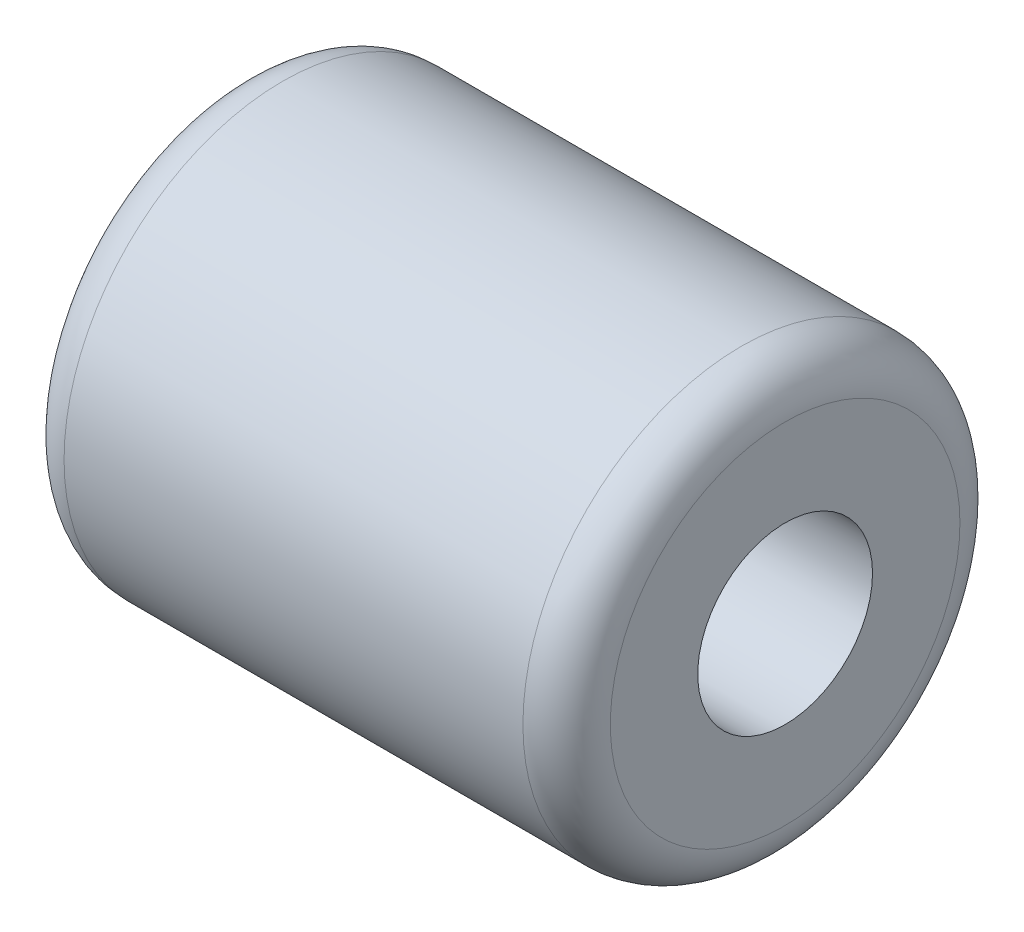
ISO-10303-21;
HEADER;
FILE_DESCRIPTION(('STEP AP214'),'2;1');
FILE_NAME('part.step','',(''),(''),'','','');
FILE_SCHEMA(('AUTOMOTIVE_DESIGN { 1 0 10303 214 1 1 1 1 }'));
ENDSEC;
DATA;
#1=APPLICATION_CONTEXT('core data for automotive mechanical design processes');
#2=APPLICATION_PROTOCOL_DEFINITION('international standard','automotive_design',2000,#1);
#3=PRODUCT_CONTEXT('',#1,'mechanical');
#4=PRODUCT('Part','Part','',(#3));
#5=PRODUCT_RELATED_PRODUCT_CATEGORY('part','',(#4));
#6=PRODUCT_DEFINITION_FORMATION('','',#4);
#7=PRODUCT_DEFINITION_CONTEXT('part definition',#1,'design');
#8=PRODUCT_DEFINITION('design','',#6,#7);
#9=PRODUCT_DEFINITION_SHAPE('','',#8);
#10=(LENGTH_UNIT() NAMED_UNIT(*) SI_UNIT(.MILLI.,.METRE.));
#11=(NAMED_UNIT(*) PLANE_ANGLE_UNIT() SI_UNIT($,.RADIAN.));
#12=(NAMED_UNIT(*) SI_UNIT($,.STERADIAN.) SOLID_ANGLE_UNIT());
#13=UNCERTAINTY_MEASURE_WITH_UNIT(LENGTH_MEASURE(1.E-05),#10,'distance_accuracy_value','');
#14=(GEOMETRIC_REPRESENTATION_CONTEXT(3) GLOBAL_UNCERTAINTY_ASSIGNED_CONTEXT((#13)) GLOBAL_UNIT_ASSIGNED_CONTEXT((#10,
#11,#12)) REPRESENTATION_CONTEXT('',''));
#15=CARTESIAN_POINT('',(0.,0.,0.));
#16=DIRECTION('',(0.,0.,1.));
#17=DIRECTION('',(1.,0.,0.));
#18=AXIS2_PLACEMENT_3D('',#15,#16,#17);
#19=CARTESIAN_POINT('',(25.,0.,0.));
#20=DIRECTION('',(-1.,0.,0.));
#21=DIRECTION('',(0.,0.,1.));
#22=AXIS2_PLACEMENT_3D('',#19,#20,#21);
#23=CYLINDRICAL_SURFACE('',#22,10.);
#24=CARTESIAN_POINT('',(23.,0.,0.));
#25=DIRECTION('',(1.,0.,0.));
#26=DIRECTION('',(0.,0.,-1.));
#27=AXIS2_PLACEMENT_3D('',#24,#25,#26);
#28=CIRCLE('',#27,10.);
#29=CARTESIAN_POINT('',(23.,0.,-10.));
#30=VERTEX_POINT('',#29);
#31=EDGE_CURVE('E38',#30,#30,#28,.F.);
#32=ORIENTED_EDGE('',*,*,#31,.T.);
#33=EDGE_LOOP('',(#32));
#34=FACE_BOUND('',#33,.T.);
#35=CARTESIAN_POINT('',(2.,0.,0.));
#36=DIRECTION('',(1.,0.,0.));
#37=DIRECTION('',(0.,0.,-1.));
#38=AXIS2_PLACEMENT_3D('',#35,#36,#37);
#39=CIRCLE('',#38,10.);
#40=CARTESIAN_POINT('',(2.,0.,-10.));
#41=VERTEX_POINT('',#40);
#42=EDGE_CURVE('E42',#41,#41,#39,.T.);
#43=ORIENTED_EDGE('',*,*,#42,.T.);
#44=EDGE_LOOP('',(#43));
#45=FACE_BOUND('',#44,.T.);
#46=ADVANCED_FACE('F31',(#34,#45),#23,.T.);
#47=CARTESIAN_POINT('',(25.,0.,0.));
#48=DIRECTION('',(1.,0.,0.));
#49=DIRECTION('',(0.,0.,-1.));
#50=AXIS2_PLACEMENT_3D('',#47,#48,#49);
#51=PLANE('',#50);
#52=CARTESIAN_POINT('',(25.,0.,0.));
#53=DIRECTION('',(1.,0.,0.));
#54=DIRECTION('',(0.,0.,-1.));
#55=AXIS2_PLACEMENT_3D('',#52,#53,#54);
#56=CIRCLE('',#55,8.);
#57=CARTESIAN_POINT('',(25.,0.,-8.));
#58=VERTEX_POINT('',#57);
#59=EDGE_CURVE('E46',#58,#58,#56,.T.);
#60=ORIENTED_EDGE('',*,*,#59,.T.);
#61=EDGE_LOOP('',(#60));
#62=FACE_BOUND('',#61,.T.);
#63=CARTESIAN_POINT('',(25.,0.,0.));
#64=DIRECTION('',(1.,0.,0.));
#65=DIRECTION('',(0.,0.,-1.));
#66=AXIS2_PLACEMENT_3D('',#63,#64,#65);
#67=CIRCLE('',#66,4.);
#68=CARTESIAN_POINT('',(25.,0.,-4.));
#69=VERTEX_POINT('',#68);
#70=EDGE_CURVE('E52',#69,#69,#67,.T.);
#71=ORIENTED_EDGE('',*,*,#70,.F.);
#72=EDGE_LOOP('',(#71));
#73=FACE_BOUND('',#72,.T.);
#74=ADVANCED_FACE('F67',(#62,#73),#51,.T.);
#75=CARTESIAN_POINT('',(0.,0.,0.));
#76=DIRECTION('',(1.,0.,0.));
#77=DIRECTION('',(0.,0.,-1.));
#78=AXIS2_PLACEMENT_3D('',#75,#76,#77);
#79=PLANE('',#78);
#80=CARTESIAN_POINT('',(0.,0.,0.));
#81=DIRECTION('',(1.,0.,0.));
#82=DIRECTION('',(0.,0.,-1.));
#83=AXIS2_PLACEMENT_3D('',#80,#81,#82);
#84=CIRCLE('',#83,8.);
#85=CARTESIAN_POINT('',(0.,0.,-8.));
#86=VERTEX_POINT('',#85);
#87=EDGE_CURVE('E10',#86,#86,#84,.F.);
#88=ORIENTED_EDGE('',*,*,#87,.T.);
#89=EDGE_LOOP('',(#88));
#90=FACE_BOUND('',#89,.T.);
#91=CARTESIAN_POINT('',(0.,0.,0.));
#92=DIRECTION('',(1.,0.,0.));
#93=DIRECTION('',(0.,0.,-1.));
#94=AXIS2_PLACEMENT_3D('',#91,#92,#93);
#95=CIRCLE('',#94,4.);
#96=CARTESIAN_POINT('',(0.,0.,-4.));
#97=VERTEX_POINT('',#96);
#98=EDGE_CURVE('E51',#97,#97,#95,.T.);
#99=ORIENTED_EDGE('',*,*,#98,.T.);
#100=EDGE_LOOP('',(#99));
#101=FACE_BOUND('',#100,.T.);
#102=ADVANCED_FACE('F58',(#90,#101),#79,.F.);
#103=CARTESIAN_POINT('',(0.,0.,0.));
#104=DIRECTION('',(1.,0.,0.));
#105=DIRECTION('',(0.,0.,-1.));
#106=AXIS2_PLACEMENT_3D('',#103,#104,#105);
#107=CYLINDRICAL_SURFACE('',#106,4.);
#108=ORIENTED_EDGE('',*,*,#98,.F.);
#109=EDGE_LOOP('',(#108));
#110=FACE_BOUND('',#109,.T.);
#111=ORIENTED_EDGE('',*,*,#70,.T.);
#112=EDGE_LOOP('',(#111));
#113=FACE_BOUND('',#112,.T.);
#114=ADVANCED_FACE('F60',(#110,#113),#107,.F.);
#115=CARTESIAN_POINT('',(23.,0.,0.));
#116=DIRECTION('',(1.,0.,0.));
#117=DIRECTION('',(0.,0.,-1.));
#118=AXIS2_PLACEMENT_3D('',#115,#116,#117);
#119=TOROIDAL_SURFACE('',#118,8.,2.);
#120=ORIENTED_EDGE('',*,*,#31,.F.);
#121=EDGE_LOOP('',(#120));
#122=FACE_BOUND('',#121,.T.);
#123=ORIENTED_EDGE('',*,*,#59,.F.);
#124=EDGE_LOOP('',(#123));
#125=FACE_BOUND('',#124,.T.);
#126=ADVANCED_FACE('F63',(#122,#125),#119,.T.);
#127=CARTESIAN_POINT('',(2.,0.,0.));
#128=DIRECTION('',(1.,0.,0.));
#129=DIRECTION('',(0.,0.,-1.));
#130=AXIS2_PLACEMENT_3D('',#127,#128,#129);
#131=TOROIDAL_SURFACE('',#130,8.,2.);
#132=ORIENTED_EDGE('',*,*,#87,.F.);
#133=EDGE_LOOP('',(#132));
#134=FACE_BOUND('',#133,.T.);
#135=ORIENTED_EDGE('',*,*,#42,.F.);
#136=EDGE_LOOP('',(#135));
#137=FACE_BOUND('',#136,.T.);
#138=ADVANCED_FACE('F33',(#134,#137),#131,.T.);
#139=CLOSED_SHELL('',(#46,#74,#102,#114,#126,#138));
#140=MANIFOLD_SOLID_BREP('B2',#139);
#141=ADVANCED_BREP_SHAPE_REPRESENTATION('',(#18,#140),#14);
#142=SHAPE_DEFINITION_REPRESENTATION(#9,#141);
ENDSEC;
END-ISO-10303-21;
